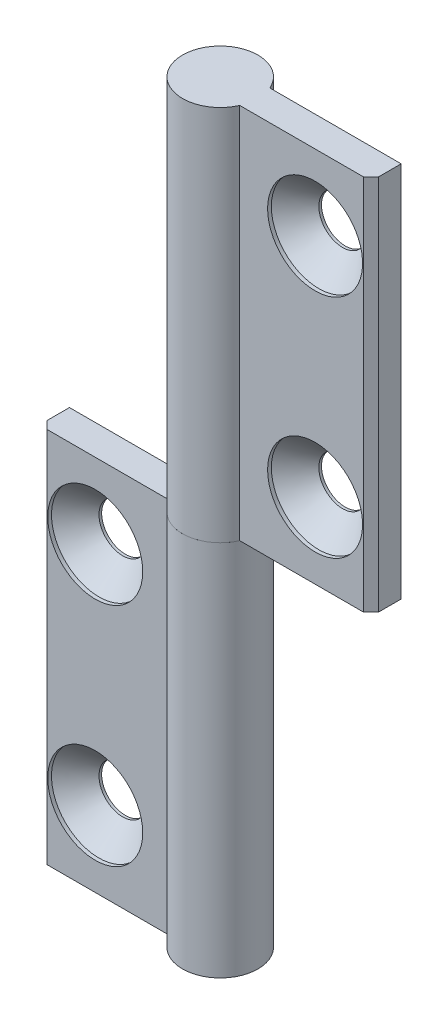
ISO-10303-21;
HEADER;
FILE_DESCRIPTION(('STEP AP214'),'2;1');
FILE_NAME('part.step','',(''),(''),'','','');
FILE_SCHEMA(('AUTOMOTIVE_DESIGN { 1 0 10303 214 1 1 1 1 }'));
ENDSEC;
DATA;
#1=APPLICATION_CONTEXT('core data for automotive mechanical design processes');
#2=APPLICATION_PROTOCOL_DEFINITION('international standard','automotive_design',2000,#1);
#3=PRODUCT_CONTEXT('',#1,'mechanical');
#4=PRODUCT('Part','Part','',(#3));
#5=PRODUCT_RELATED_PRODUCT_CATEGORY('part','',(#4));
#6=PRODUCT_DEFINITION_FORMATION('','',#4);
#7=PRODUCT_DEFINITION_CONTEXT('part definition',#1,'design');
#8=PRODUCT_DEFINITION('design','',#6,#7);
#9=PRODUCT_DEFINITION_SHAPE('','',#8);
#10=(LENGTH_UNIT() NAMED_UNIT(*) SI_UNIT(.MILLI.,.METRE.));
#11=(NAMED_UNIT(*) PLANE_ANGLE_UNIT() SI_UNIT($,.RADIAN.));
#12=(NAMED_UNIT(*) SI_UNIT($,.STERADIAN.) SOLID_ANGLE_UNIT());
#13=UNCERTAINTY_MEASURE_WITH_UNIT(LENGTH_MEASURE(1.E-05),#10,'distance_accuracy_value','');
#14=(GEOMETRIC_REPRESENTATION_CONTEXT(3) GLOBAL_UNCERTAINTY_ASSIGNED_CONTEXT((#13)) GLOBAL_UNIT_ASSIGNED_CONTEXT((#10,
#11,#12)) REPRESENTATION_CONTEXT('',''));
#15=CARTESIAN_POINT('',(0.,0.,0.));
#16=DIRECTION('',(0.,0.,1.));
#17=DIRECTION('',(1.,0.,0.));
#18=AXIS2_PLACEMENT_3D('',#15,#16,#17);
#19=CARTESIAN_POINT('',(0.,25.,0.));
#20=DIRECTION('',(0.,1.,0.));
#21=DIRECTION('',(0.,0.,-1.));
#22=AXIS2_PLACEMENT_3D('',#19,#20,#21);
#23=CYLINDRICAL_SURFACE('',#22,5.);
#24=CARTESIAN_POINT('',(0.,75.,0.));
#25=DIRECTION('',(0.,-1.,0.));
#26=DIRECTION('',(0.,0.,1.));
#27=AXIS2_PLACEMENT_3D('',#24,#25,#26);
#28=CIRCLE('',#27,5.);
#29=CARTESIAN_POINT('',(4.58257569495585,75.,1.99999999999997));
#30=VERTEX_POINT('',#29);
#31=CARTESIAN_POINT('',(4.58257569495582,75.,-2.00000000000004));
#32=VERTEX_POINT('',#31);
#33=EDGE_CURVE('E120',#30,#32,#28,.T.);
#34=ORIENTED_EDGE('',*,*,#33,.T.);
#35=DIRECTION('',(0.,1.,0.));
#36=VECTOR('',#35,1.);
#37=CARTESIAN_POINT('',(4.58257569495582,25.,-2.00000000000004));
#38=LINE('',#37,#36);
#39=CARTESIAN_POINT('',(4.58257569495582,25.,-2.00000000000004));
#40=VERTEX_POINT('',#39);
#41=EDGE_CURVE('E12',#40,#32,#38,.T.);
#42=ORIENTED_EDGE('',*,*,#41,.F.);
#43=CARTESIAN_POINT('',(0.,25.,0.));
#44=DIRECTION('',(0.,-1.,0.));
#45=DIRECTION('',(0.,0.,1.));
#46=AXIS2_PLACEMENT_3D('',#43,#44,#45);
#47=CIRCLE('',#46,5.);
#48=CARTESIAN_POINT('',(4.58257569495585,25.,1.99999999999997));
#49=VERTEX_POINT('',#48);
#50=EDGE_CURVE('E129',#49,#40,#47,.T.);
#51=ORIENTED_EDGE('',*,*,#50,.F.);
#52=DIRECTION('',(0.,1.,0.));
#53=VECTOR('',#52,1.);
#54=CARTESIAN_POINT('',(4.58257569495585,25.,1.99999999999997));
#55=LINE('',#54,#53);
#56=EDGE_CURVE('E116',#49,#30,#55,.T.);
#57=ORIENTED_EDGE('',*,*,#56,.T.);
#58=EDGE_LOOP('',(#34,#42,#51,#57));
#59=FACE_BOUND('',#58,.T.);
#60=ADVANCED_FACE('F44',(#59),#23,.T.);
#61=CARTESIAN_POINT('',(4.58257569495582,25.,-2.00000000000004));
#62=DIRECTION('',(0.,0.,1.));
#63=DIRECTION('',(-1.,0.,0.));
#64=AXIS2_PLACEMENT_3D('',#61,#62,#63);
#65=PLANE('',#64);
#66=CARTESIAN_POINT('',(14.5825756949558,35.,-2.00000000000011));
#67=DIRECTION('',(0.,0.,1.));
#68=DIRECTION('',(-1.,0.,0.));
#69=AXIS2_PLACEMENT_3D('',#66,#67,#68);
#70=CIRCLE('',#69,3.15);
#71=CARTESIAN_POINT('',(11.4325756949558,35.,-2.00000000000009));
#72=VERTEX_POINT('',#71);
#73=EDGE_CURVE('E47',#72,#72,#70,.T.);
#74=ORIENTED_EDGE('',*,*,#73,.T.);
#75=EDGE_LOOP('',(#74));
#76=FACE_BOUND('',#75,.T.);
#77=CARTESIAN_POINT('',(14.5825756949558,65.,-2.00000000000011));
#78=DIRECTION('',(0.,0.,1.));
#79=DIRECTION('',(-1.,0.,0.));
#80=AXIS2_PLACEMENT_3D('',#77,#78,#79);
#81=CIRCLE('',#80,3.15);
#82=CARTESIAN_POINT('',(11.4325756949558,65.,-2.00000000000009));
#83=VERTEX_POINT('',#82);
#84=EDGE_CURVE('E124',#83,#83,#81,.T.);
#85=ORIENTED_EDGE('',*,*,#84,.T.);
#86=EDGE_LOOP('',(#85));
#87=FACE_BOUND('',#86,.T.);
#88=DIRECTION('',(1.,0.,0.));
#89=VECTOR('',#88,1.);
#90=CARTESIAN_POINT('',(4.58257569495582,75.,-2.00000000000004));
#91=LINE('',#90,#89);
#92=CARTESIAN_POINT('',(22.,75.,-2.00000000000016));
#93=VERTEX_POINT('',#92);
#94=EDGE_CURVE('E123',#32,#93,#91,.T.);
#95=ORIENTED_EDGE('',*,*,#94,.T.);
#96=DIRECTION('',(0.,1.,0.));
#97=VECTOR('',#96,1.);
#98=CARTESIAN_POINT('',(22.,25.,-2.00000000000016));
#99=LINE('',#98,#97);
#100=CARTESIAN_POINT('',(22.,25.,-2.00000000000016));
#101=VERTEX_POINT('',#100);
#102=EDGE_CURVE('E53',#101,#93,#99,.T.);
#103=ORIENTED_EDGE('',*,*,#102,.F.);
#104=DIRECTION('',(1.,0.,0.));
#105=VECTOR('',#104,1.);
#106=CARTESIAN_POINT('',(4.58257569495582,25.,-2.00000000000004));
#107=LINE('',#106,#105);
#108=EDGE_CURVE('E96',#40,#101,#107,.T.);
#109=ORIENTED_EDGE('',*,*,#108,.F.);
#110=ORIENTED_EDGE('',*,*,#41,.T.);
#111=EDGE_LOOP('',(#95,#103,#109,#110));
#112=FACE_BOUND('',#111,.T.);
#113=ADVANCED_FACE('F150',(#76,#87,#112),#65,.F.);
#114=CARTESIAN_POINT('',(22.,25.,-2.00000000000016));
#115=DIRECTION('',(-1.,0.,0.));
#116=DIRECTION('',(0.,0.,-1.));
#117=AXIS2_PLACEMENT_3D('',#114,#115,#116);
#118=PLANE('',#117);
#119=DIRECTION('',(0.,0.,1.));
#120=VECTOR('',#119,1.);
#121=CARTESIAN_POINT('',(22.,75.,-2.00000000000016));
#122=LINE('',#121,#120);
#123=CARTESIAN_POINT('',(22.,75.,0.999999999999837));
#124=VERTEX_POINT('',#123);
#125=EDGE_CURVE('E111',#93,#124,#122,.T.);
#126=ORIENTED_EDGE('',*,*,#125,.T.);
#127=DIRECTION('',(0.,1.,0.));
#128=VECTOR('',#127,1.);
#129=CARTESIAN_POINT('',(22.,25.,0.999999999999837));
#130=LINE('',#129,#128);
#131=CARTESIAN_POINT('',(22.,25.,0.999999999999837));
#132=VERTEX_POINT('',#131);
#133=EDGE_CURVE('E108',#132,#124,#130,.T.);
#134=ORIENTED_EDGE('',*,*,#133,.F.);
#135=DIRECTION('',(0.,0.,1.));
#136=VECTOR('',#135,1.);
#137=CARTESIAN_POINT('',(22.,25.,-2.00000000000016));
#138=LINE('',#137,#136);
#139=EDGE_CURVE('E100',#101,#132,#138,.T.);
#140=ORIENTED_EDGE('',*,*,#139,.F.);
#141=ORIENTED_EDGE('',*,*,#102,.T.);
#142=EDGE_LOOP('',(#126,#134,#140,#141));
#143=FACE_BOUND('',#142,.T.);
#144=ADVANCED_FACE('F109',(#143),#118,.F.);
#145=CARTESIAN_POINT('',(22.,25.,0.999999999999837));
#146=DIRECTION('',(-0.707106781186549,0.,-0.707106781186546));
#147=DIRECTION('',(0.707106781186546,0.,-0.707106781186549));
#148=AXIS2_PLACEMENT_3D('',#145,#146,#147);
#149=PLANE('',#148);
#150=DIRECTION('',(-0.707106781186546,0.,0.707106781186549));
#151=VECTOR('',#150,1.);
#152=CARTESIAN_POINT('',(22.,75.,0.999999999999837));
#153=LINE('',#152,#151);
#154=CARTESIAN_POINT('',(21.,75.,1.99999999999984));
#155=VERTEX_POINT('',#154);
#156=EDGE_CURVE('E82',#124,#155,#153,.T.);
#157=ORIENTED_EDGE('',*,*,#156,.T.);
#158=DIRECTION('',(0.,1.,0.));
#159=VECTOR('',#158,1.);
#160=CARTESIAN_POINT('',(21.,25.,1.99999999999984));
#161=LINE('',#160,#159);
#162=CARTESIAN_POINT('',(21.,25.,1.99999999999984));
#163=VERTEX_POINT('',#162);
#164=EDGE_CURVE('E112',#163,#155,#161,.T.);
#165=ORIENTED_EDGE('',*,*,#164,.F.);
#166=DIRECTION('',(-0.707106781186546,0.,0.707106781186549));
#167=VECTOR('',#166,1.);
#168=CARTESIAN_POINT('',(22.,25.,0.999999999999837));
#169=LINE('',#168,#167);
#170=EDGE_CURVE('E104',#132,#163,#169,.T.);
#171=ORIENTED_EDGE('',*,*,#170,.F.);
#172=ORIENTED_EDGE('',*,*,#133,.T.);
#173=EDGE_LOOP('',(#157,#165,#171,#172));
#174=FACE_BOUND('',#173,.T.);
#175=ADVANCED_FACE('F114',(#174),#149,.F.);
#176=CARTESIAN_POINT('',(21.,25.,1.99999999999984));
#177=DIRECTION('',(0.,0.,-1.));
#178=DIRECTION('',(1.,0.,0.));
#179=AXIS2_PLACEMENT_3D('',#176,#177,#178);
#180=PLANE('',#179);
#181=CARTESIAN_POINT('',(14.5825756949559,35.,1.99999999999989));
#182=DIRECTION('',(0.,0.,1.));
#183=DIRECTION('',(-1.,0.,0.));
#184=AXIS2_PLACEMENT_3D('',#181,#182,#183);
#185=CIRCLE('',#184,6.3);
#186=CARTESIAN_POINT('',(8.28257569495585,35.,1.99999999999994));
#187=VERTEX_POINT('',#186);
#188=EDGE_CURVE('E184',#187,#187,#185,.T.);
#189=ORIENTED_EDGE('',*,*,#188,.F.);
#190=EDGE_LOOP('',(#189));
#191=FACE_BOUND('',#190,.T.);
#192=CARTESIAN_POINT('',(14.5825756949559,65.,1.99999999999989));
#193=DIRECTION('',(0.,0.,1.));
#194=DIRECTION('',(-1.,0.,0.));
#195=AXIS2_PLACEMENT_3D('',#192,#193,#194);
#196=CIRCLE('',#195,6.3);
#197=CARTESIAN_POINT('',(8.28257569495585,65.,1.99999999999994));
#198=VERTEX_POINT('',#197);
#199=EDGE_CURVE('E142',#198,#198,#196,.T.);
#200=ORIENTED_EDGE('',*,*,#199,.F.);
#201=EDGE_LOOP('',(#200));
#202=FACE_BOUND('',#201,.T.);
#203=DIRECTION('',(-1.,0.,0.));
#204=VECTOR('',#203,1.);
#205=CARTESIAN_POINT('',(21.,75.,1.99999999999984));
#206=LINE('',#205,#204);
#207=EDGE_CURVE('E88',#155,#30,#206,.T.);
#208=ORIENTED_EDGE('',*,*,#207,.T.);
#209=ORIENTED_EDGE('',*,*,#56,.F.);
#210=DIRECTION('',(-1.,0.,0.));
#211=VECTOR('',#210,1.);
#212=CARTESIAN_POINT('',(21.,25.,1.99999999999984));
#213=LINE('',#212,#211);
#214=EDGE_CURVE('E62',#163,#49,#213,.T.);
#215=ORIENTED_EDGE('',*,*,#214,.F.);
#216=ORIENTED_EDGE('',*,*,#164,.T.);
#217=EDGE_LOOP('',(#208,#209,#215,#216));
#218=FACE_BOUND('',#217,.T.);
#219=ADVANCED_FACE('F162',(#191,#202,#218),#180,.F.);
#220=CARTESIAN_POINT('',(0.,25.,0.));
#221=DIRECTION('',(0.,-1.,0.));
#222=DIRECTION('',(0.,0.,1.));
#223=AXIS2_PLACEMENT_3D('',#220,#221,#222);
#224=PLANE('',#223);
#225=ORIENTED_EDGE('',*,*,#50,.T.);
#226=ORIENTED_EDGE('',*,*,#108,.T.);
#227=ORIENTED_EDGE('',*,*,#139,.T.);
#228=ORIENTED_EDGE('',*,*,#170,.T.);
#229=ORIENTED_EDGE('',*,*,#214,.T.);
#230=EDGE_LOOP('',(#225,#226,#227,#228,#229));
#231=FACE_BOUND('',#230,.T.);
#232=ADVANCED_FACE('F102',(#231),#224,.T.);
#233=CARTESIAN_POINT('',(0.,75.,0.));
#234=DIRECTION('',(0.,-1.,0.));
#235=DIRECTION('',(0.,0.,1.));
#236=AXIS2_PLACEMENT_3D('',#233,#234,#235);
#237=PLANE('',#236);
#238=ORIENTED_EDGE('',*,*,#33,.F.);
#239=ORIENTED_EDGE('',*,*,#207,.F.);
#240=ORIENTED_EDGE('',*,*,#156,.F.);
#241=ORIENTED_EDGE('',*,*,#125,.F.);
#242=ORIENTED_EDGE('',*,*,#94,.F.);
#243=EDGE_LOOP('',(#238,#239,#240,#241,#242));
#244=FACE_BOUND('',#243,.T.);
#245=ADVANCED_FACE('F152',(#244),#237,.F.);
#246=CARTESIAN_POINT('',(14.5825756949559,65.,1.99999999999989));
#247=DIRECTION('',(0.,0.,1.));
#248=DIRECTION('',(-1.,0.,0.));
#249=AXIS2_PLACEMENT_3D('',#246,#247,#248);
#250=CYLINDRICAL_SURFACE('',#249,3.15);
#251=CARTESIAN_POINT('',(14.5825756949558,65.,-1.65000000000011));
#252=DIRECTION('',(0.,0.,1.));
#253=DIRECTION('',(-1.,0.,0.));
#254=AXIS2_PLACEMENT_3D('',#251,#252,#253);
#255=CIRCLE('',#254,3.15);
#256=CARTESIAN_POINT('',(11.4325756949558,65.,-1.65000000000008));
#257=VERTEX_POINT('',#256);
#258=EDGE_CURVE('E133',#257,#257,#255,.T.);
#259=ORIENTED_EDGE('',*,*,#258,.T.);
#260=EDGE_LOOP('',(#259));
#261=FACE_BOUND('',#260,.T.);
#262=ORIENTED_EDGE('',*,*,#84,.F.);
#263=EDGE_LOOP('',(#262));
#264=FACE_BOUND('',#263,.T.);
#265=ADVANCED_FACE('F154',(#261,#264),#250,.F.);
#266=CARTESIAN_POINT('',(14.5825756949558,65.,1.49999999999989));
#267=DIRECTION('',(0.,0.,1.));
#268=DIRECTION('',(-1.,0.,0.));
#269=AXIS2_PLACEMENT_3D('',#266,#267,#268);
#270=CONICAL_SURFACE('',#269,6.3,0.785398163397449);
#271=ORIENTED_EDGE('',*,*,#258,.F.);
#272=EDGE_LOOP('',(#271));
#273=FACE_BOUND('',#272,.T.);
#274=CARTESIAN_POINT('',(14.5825756949558,65.,1.49999999999989));
#275=DIRECTION('',(0.,0.,1.));
#276=DIRECTION('',(-1.,0.,0.));
#277=AXIS2_PLACEMENT_3D('',#274,#275,#276);
#278=CIRCLE('',#277,6.3);
#279=CARTESIAN_POINT('',(8.28257569495585,65.,1.49999999999994));
#280=VERTEX_POINT('',#279);
#281=EDGE_CURVE('E137',#280,#280,#278,.T.);
#282=ORIENTED_EDGE('',*,*,#281,.T.);
#283=EDGE_LOOP('',(#282));
#284=FACE_BOUND('',#283,.T.);
#285=ADVANCED_FACE('F160',(#273,#284),#270,.F.);
#286=CARTESIAN_POINT('',(14.5825756949559,65.,1.99999999999989));
#287=DIRECTION('',(0.,0.,1.));
#288=DIRECTION('',(-1.,0.,0.));
#289=AXIS2_PLACEMENT_3D('',#286,#287,#288);
#290=CYLINDRICAL_SURFACE('',#289,6.3);
#291=ORIENTED_EDGE('',*,*,#281,.F.);
#292=EDGE_LOOP('',(#291));
#293=FACE_BOUND('',#292,.T.);
#294=ORIENTED_EDGE('',*,*,#199,.T.);
#295=EDGE_LOOP('',(#294));
#296=FACE_BOUND('',#295,.T.);
#297=ADVANCED_FACE('F211',(#293,#296),#290,.F.);
#298=CARTESIAN_POINT('',(14.5825756949559,35.,1.99999999999989));
#299=DIRECTION('',(0.,0.,1.));
#300=DIRECTION('',(-1.,0.,0.));
#301=AXIS2_PLACEMENT_3D('',#298,#299,#300);
#302=CYLINDRICAL_SURFACE('',#301,3.15);
#303=CARTESIAN_POINT('',(14.5825756949558,35.,-1.65000000000011));
#304=DIRECTION('',(0.,0.,1.));
#305=DIRECTION('',(-1.,0.,0.));
#306=AXIS2_PLACEMENT_3D('',#303,#304,#305);
#307=CIRCLE('',#306,3.15);
#308=CARTESIAN_POINT('',(11.4325756949558,35.,-1.65000000000008));
#309=VERTEX_POINT('',#308);
#310=EDGE_CURVE('E188',#309,#309,#307,.T.);
#311=ORIENTED_EDGE('',*,*,#310,.T.);
#312=EDGE_LOOP('',(#311));
#313=FACE_BOUND('',#312,.T.);
#314=ORIENTED_EDGE('',*,*,#73,.F.);
#315=EDGE_LOOP('',(#314));
#316=FACE_BOUND('',#315,.T.);
#317=ADVANCED_FACE('F204',(#313,#316),#302,.F.);
#318=CARTESIAN_POINT('',(14.5825756949558,35.,1.49999999999989));
#319=DIRECTION('',(0.,0.,1.));
#320=DIRECTION('',(-1.,0.,0.));
#321=AXIS2_PLACEMENT_3D('',#318,#319,#320);
#322=CONICAL_SURFACE('',#321,6.3,0.785398163397449);
#323=ORIENTED_EDGE('',*,*,#310,.F.);
#324=EDGE_LOOP('',(#323));
#325=FACE_BOUND('',#324,.T.);
#326=CARTESIAN_POINT('',(14.5825756949558,35.,1.49999999999989));
#327=DIRECTION('',(0.,0.,1.));
#328=DIRECTION('',(-1.,0.,0.));
#329=AXIS2_PLACEMENT_3D('',#326,#327,#328);
#330=CIRCLE('',#329,6.3);
#331=CARTESIAN_POINT('',(8.28257569495585,35.,1.49999999999994));
#332=VERTEX_POINT('',#331);
#333=EDGE_CURVE('E192',#332,#332,#330,.T.);
#334=ORIENTED_EDGE('',*,*,#333,.T.);
#335=EDGE_LOOP('',(#334));
#336=FACE_BOUND('',#335,.T.);
#337=ADVANCED_FACE('F198',(#325,#336),#322,.F.);
#338=CARTESIAN_POINT('',(14.5825756949559,35.,1.99999999999989));
#339=DIRECTION('',(0.,0.,1.));
#340=DIRECTION('',(-1.,0.,0.));
#341=AXIS2_PLACEMENT_3D('',#338,#339,#340);
#342=CYLINDRICAL_SURFACE('',#341,6.3);
#343=ORIENTED_EDGE('',*,*,#333,.F.);
#344=EDGE_LOOP('',(#343));
#345=FACE_BOUND('',#344,.T.);
#346=ORIENTED_EDGE('',*,*,#188,.T.);
#347=EDGE_LOOP('',(#346));
#348=FACE_BOUND('',#347,.T.);
#349=ADVANCED_FACE('F196',(#345,#348),#342,.F.);
#350=CLOSED_SHELL('',(#60,#113,#144,#175,#219,#232,#245,#265,#285,#297,#317,#337,#349));
#351=MANIFOLD_SOLID_BREP('B2',#350);
#352=CARTESIAN_POINT('',(0.,25.,0.));
#353=DIRECTION('',(0.,-1.,0.));
#354=DIRECTION('',(0.,0.,-1.));
#355=AXIS2_PLACEMENT_3D('',#352,#353,#354);
#356=CYLINDRICAL_SURFACE('',#355,5.);
#357=CARTESIAN_POINT('',(0.,-25.,0.));
#358=DIRECTION('',(0.,1.,0.));
#359=DIRECTION('',(0.,0.,1.));
#360=AXIS2_PLACEMENT_3D('',#357,#358,#359);
#361=CIRCLE('',#360,5.);
#362=CARTESIAN_POINT('',(-4.58257569495584,-25.,2.));
#363=VERTEX_POINT('',#362);
#364=CARTESIAN_POINT('',(-4.58257569495584,-25.,-2.));
#365=VERTEX_POINT('',#364);
#366=EDGE_CURVE('E371',#363,#365,#361,.T.);
#367=ORIENTED_EDGE('',*,*,#366,.T.);
#368=DIRECTION('',(0.,-1.,0.));
#369=VECTOR('',#368,1.);
#370=CARTESIAN_POINT('',(-4.58257569495584,25.,-2.));
#371=LINE('',#370,#369);
#372=CARTESIAN_POINT('',(-4.58257569495584,25.,-2.));
#373=VERTEX_POINT('',#372);
#374=EDGE_CURVE('E42',#373,#365,#371,.T.);
#375=ORIENTED_EDGE('',*,*,#374,.F.);
#376=CARTESIAN_POINT('',(0.,25.,0.));
#377=DIRECTION('',(0.,1.,0.));
#378=DIRECTION('',(0.,0.,1.));
#379=AXIS2_PLACEMENT_3D('',#376,#377,#378);
#380=CIRCLE('',#379,5.);
#381=CARTESIAN_POINT('',(-4.58257569495584,25.,2.));
#382=VERTEX_POINT('',#381);
#383=EDGE_CURVE('E380',#382,#373,#380,.T.);
#384=ORIENTED_EDGE('',*,*,#383,.F.);
#385=DIRECTION('',(0.,-1.,0.));
#386=VECTOR('',#385,1.);
#387=CARTESIAN_POINT('',(-4.58257569495584,25.,2.));
#388=LINE('',#387,#386);
#389=EDGE_CURVE('E367',#382,#363,#388,.T.);
#390=ORIENTED_EDGE('',*,*,#389,.T.);
#391=EDGE_LOOP('',(#367,#375,#384,#390));
#392=FACE_BOUND('',#391,.T.);
#393=ADVANCED_FACE('F295',(#392),#356,.T.);
#394=CARTESIAN_POINT('',(-4.58257569495584,25.,-2.));
#395=DIRECTION('',(0.,0.,1.));
#396=DIRECTION('',(1.,0.,0.));
#397=AXIS2_PLACEMENT_3D('',#394,#395,#396);
#398=PLANE('',#397);
#399=CARTESIAN_POINT('',(-14.5825756949558,15.,-2.));
#400=DIRECTION('',(0.,0.,1.));
#401=DIRECTION('',(1.,0.,0.));
#402=AXIS2_PLACEMENT_3D('',#399,#400,#401);
#403=CIRCLE('',#402,3.15);
#404=CARTESIAN_POINT('',(-11.4325756949558,15.,-2.));
#405=VERTEX_POINT('',#404);
#406=EDGE_CURVE('E298',#405,#405,#403,.T.);
#407=ORIENTED_EDGE('',*,*,#406,.T.);
#408=EDGE_LOOP('',(#407));
#409=FACE_BOUND('',#408,.T.);
#410=CARTESIAN_POINT('',(-14.5825756949558,-15.,-2.));
#411=DIRECTION('',(0.,0.,1.));
#412=DIRECTION('',(1.,0.,0.));
#413=AXIS2_PLACEMENT_3D('',#410,#411,#412);
#414=CIRCLE('',#413,3.15);
#415=CARTESIAN_POINT('',(-11.4325756949558,-15.,-2.));
#416=VERTEX_POINT('',#415);
#417=EDGE_CURVE('E375',#416,#416,#414,.T.);
#418=ORIENTED_EDGE('',*,*,#417,.T.);
#419=EDGE_LOOP('',(#418));
#420=FACE_BOUND('',#419,.T.);
#421=DIRECTION('',(-1.,0.,0.));
#422=VECTOR('',#421,1.);
#423=CARTESIAN_POINT('',(-4.58257569495584,-25.,-2.));
#424=LINE('',#423,#422);
#425=CARTESIAN_POINT('',(-22.,-25.,-2.));
#426=VERTEX_POINT('',#425);
#427=EDGE_CURVE('E374',#365,#426,#424,.T.);
#428=ORIENTED_EDGE('',*,*,#427,.T.);
#429=DIRECTION('',(0.,-1.,0.));
#430=VECTOR('',#429,1.);
#431=CARTESIAN_POINT('',(-22.,25.,-2.));
#432=LINE('',#431,#430);
#433=CARTESIAN_POINT('',(-22.,25.,-2.));
#434=VERTEX_POINT('',#433);
#435=EDGE_CURVE('E304',#434,#426,#432,.T.);
#436=ORIENTED_EDGE('',*,*,#435,.F.);
#437=DIRECTION('',(-1.,0.,0.));
#438=VECTOR('',#437,1.);
#439=CARTESIAN_POINT('',(-4.58257569495584,25.,-2.));
#440=LINE('',#439,#438);
#441=EDGE_CURVE('E347',#373,#434,#440,.T.);
#442=ORIENTED_EDGE('',*,*,#441,.F.);
#443=ORIENTED_EDGE('',*,*,#374,.T.);
#444=EDGE_LOOP('',(#428,#436,#442,#443));
#445=FACE_BOUND('',#444,.T.);
#446=ADVANCED_FACE('F401',(#409,#420,#445),#398,.F.);
#447=CARTESIAN_POINT('',(-22.,25.,-2.));
#448=DIRECTION('',(1.,0.,0.));
#449=DIRECTION('',(0.,0.,-1.));
#450=AXIS2_PLACEMENT_3D('',#447,#448,#449);
#451=PLANE('',#450);
#452=DIRECTION('',(0.,0.,1.));
#453=VECTOR('',#452,1.);
#454=CARTESIAN_POINT('',(-22.,-25.,-2.));
#455=LINE('',#454,#453);
#456=CARTESIAN_POINT('',(-22.,-25.,1.));
#457=VERTEX_POINT('',#456);
#458=EDGE_CURVE('E362',#426,#457,#455,.T.);
#459=ORIENTED_EDGE('',*,*,#458,.T.);
#460=DIRECTION('',(0.,-1.,0.));
#461=VECTOR('',#460,1.);
#462=CARTESIAN_POINT('',(-22.,25.,1.));
#463=LINE('',#462,#461);
#464=CARTESIAN_POINT('',(-22.,25.,1.));
#465=VERTEX_POINT('',#464);
#466=EDGE_CURVE('E359',#465,#457,#463,.T.);
#467=ORIENTED_EDGE('',*,*,#466,.F.);
#468=DIRECTION('',(0.,0.,1.));
#469=VECTOR('',#468,1.);
#470=CARTESIAN_POINT('',(-22.,25.,-2.));
#471=LINE('',#470,#469);
#472=EDGE_CURVE('E351',#434,#465,#471,.T.);
#473=ORIENTED_EDGE('',*,*,#472,.F.);
#474=ORIENTED_EDGE('',*,*,#435,.T.);
#475=EDGE_LOOP('',(#459,#467,#473,#474));
#476=FACE_BOUND('',#475,.T.);
#477=ADVANCED_FACE('F360',(#476),#451,.F.);
#478=CARTESIAN_POINT('',(-22.,25.,1.));
#479=DIRECTION('',(0.707106781186543,0.,-0.707106781186552));
#480=DIRECTION('',(-0.707106781186552,0.,-0.707106781186543));
#481=AXIS2_PLACEMENT_3D('',#478,#479,#480);
#482=PLANE('',#481);
#483=DIRECTION('',(0.707106781186552,0.,0.707106781186543));
#484=VECTOR('',#483,1.);
#485=CARTESIAN_POINT('',(-22.,-25.,1.));
#486=LINE('',#485,#484);
#487=CARTESIAN_POINT('',(-21.,-25.,2.));
#488=VERTEX_POINT('',#487);
#489=EDGE_CURVE('E333',#457,#488,#486,.T.);
#490=ORIENTED_EDGE('',*,*,#489,.T.);
#491=DIRECTION('',(0.,-1.,0.));
#492=VECTOR('',#491,1.);
#493=CARTESIAN_POINT('',(-21.,25.,2.));
#494=LINE('',#493,#492);
#495=CARTESIAN_POINT('',(-21.,25.,2.));
#496=VERTEX_POINT('',#495);
#497=EDGE_CURVE('E363',#496,#488,#494,.T.);
#498=ORIENTED_EDGE('',*,*,#497,.F.);
#499=DIRECTION('',(0.707106781186552,0.,0.707106781186543));
#500=VECTOR('',#499,1.);
#501=CARTESIAN_POINT('',(-22.,25.,1.));
#502=LINE('',#501,#500);
#503=EDGE_CURVE('E355',#465,#496,#502,.T.);
#504=ORIENTED_EDGE('',*,*,#503,.F.);
#505=ORIENTED_EDGE('',*,*,#466,.T.);
#506=EDGE_LOOP('',(#490,#498,#504,#505));
#507=FACE_BOUND('',#506,.T.);
#508=ADVANCED_FACE('F365',(#507),#482,.F.);
#509=CARTESIAN_POINT('',(-21.,25.,2.));
#510=DIRECTION('',(0.,0.,-1.));
#511=DIRECTION('',(-1.,0.,0.));
#512=AXIS2_PLACEMENT_3D('',#509,#510,#511);
#513=PLANE('',#512);
#514=CARTESIAN_POINT('',(-14.5825756949558,15.,2.));
#515=DIRECTION('',(0.,0.,1.));
#516=DIRECTION('',(1.,0.,0.));
#517=AXIS2_PLACEMENT_3D('',#514,#515,#516);
#518=CIRCLE('',#517,6.3);
#519=CARTESIAN_POINT('',(-8.28257569495584,15.,2.));
#520=VERTEX_POINT('',#519);
#521=EDGE_CURVE('E435',#520,#520,#518,.T.);
#522=ORIENTED_EDGE('',*,*,#521,.F.);
#523=EDGE_LOOP('',(#522));
#524=FACE_BOUND('',#523,.T.);
#525=CARTESIAN_POINT('',(-14.5825756949558,-15.,2.));
#526=DIRECTION('',(0.,0.,1.));
#527=DIRECTION('',(1.,0.,0.));
#528=AXIS2_PLACEMENT_3D('',#525,#526,#527);
#529=CIRCLE('',#528,6.3);
#530=CARTESIAN_POINT('',(-8.28257569495584,-15.,2.));
#531=VERTEX_POINT('',#530);
#532=EDGE_CURVE('E393',#531,#531,#529,.T.);
#533=ORIENTED_EDGE('',*,*,#532,.F.);
#534=EDGE_LOOP('',(#533));
#535=FACE_BOUND('',#534,.T.);
#536=DIRECTION('',(1.,0.,0.));
#537=VECTOR('',#536,1.);
#538=CARTESIAN_POINT('',(-21.,-25.,2.));
#539=LINE('',#538,#537);
#540=EDGE_CURVE('E339',#488,#363,#539,.T.);
#541=ORIENTED_EDGE('',*,*,#540,.T.);
#542=ORIENTED_EDGE('',*,*,#389,.F.);
#543=DIRECTION('',(1.,0.,0.));
#544=VECTOR('',#543,1.);
#545=CARTESIAN_POINT('',(-21.,25.,2.));
#546=LINE('',#545,#544);
#547=EDGE_CURVE('E313',#496,#382,#546,.T.);
#548=ORIENTED_EDGE('',*,*,#547,.F.);
#549=ORIENTED_EDGE('',*,*,#497,.T.);
#550=EDGE_LOOP('',(#541,#542,#548,#549));
#551=FACE_BOUND('',#550,.T.);
#552=ADVANCED_FACE('F413',(#524,#535,#551),#513,.F.);
#553=CARTESIAN_POINT('',(0.,25.,0.));
#554=DIRECTION('',(0.,1.,0.));
#555=DIRECTION('',(0.,0.,1.));
#556=AXIS2_PLACEMENT_3D('',#553,#554,#555);
#557=PLANE('',#556);
#558=ORIENTED_EDGE('',*,*,#383,.T.);
#559=ORIENTED_EDGE('',*,*,#441,.T.);
#560=ORIENTED_EDGE('',*,*,#472,.T.);
#561=ORIENTED_EDGE('',*,*,#503,.T.);
#562=ORIENTED_EDGE('',*,*,#547,.T.);
#563=EDGE_LOOP('',(#558,#559,#560,#561,#562));
#564=FACE_BOUND('',#563,.T.);
#565=ADVANCED_FACE('F353',(#564),#557,.T.);
#566=CARTESIAN_POINT('',(0.,-25.,0.));
#567=DIRECTION('',(0.,1.,0.));
#568=DIRECTION('',(0.,0.,1.));
#569=AXIS2_PLACEMENT_3D('',#566,#567,#568);
#570=PLANE('',#569);
#571=ORIENTED_EDGE('',*,*,#366,.F.);
#572=ORIENTED_EDGE('',*,*,#540,.F.);
#573=ORIENTED_EDGE('',*,*,#489,.F.);
#574=ORIENTED_EDGE('',*,*,#458,.F.);
#575=ORIENTED_EDGE('',*,*,#427,.F.);
#576=EDGE_LOOP('',(#571,#572,#573,#574,#575));
#577=FACE_BOUND('',#576,.T.);
#578=ADVANCED_FACE('F403',(#577),#570,.F.);
#579=CARTESIAN_POINT('',(-14.5825756949558,-15.,2.));
#580=DIRECTION('',(0.,0.,1.));
#581=DIRECTION('',(1.,0.,0.));
#582=AXIS2_PLACEMENT_3D('',#579,#580,#581);
#583=CYLINDRICAL_SURFACE('',#582,3.15);
#584=CARTESIAN_POINT('',(-14.5825756949558,-15.,-1.65));
#585=DIRECTION('',(0.,0.,1.));
#586=DIRECTION('',(1.,0.,0.));
#587=AXIS2_PLACEMENT_3D('',#584,#585,#586);
#588=CIRCLE('',#587,3.15);
#589=CARTESIAN_POINT('',(-11.4325756949558,-15.,-1.65));
#590=VERTEX_POINT('',#589);
#591=EDGE_CURVE('E384',#590,#590,#588,.T.);
#592=ORIENTED_EDGE('',*,*,#591,.T.);
#593=EDGE_LOOP('',(#592));
#594=FACE_BOUND('',#593,.T.);
#595=ORIENTED_EDGE('',*,*,#417,.F.);
#596=EDGE_LOOP('',(#595));
#597=FACE_BOUND('',#596,.T.);
#598=ADVANCED_FACE('F405',(#594,#597),#583,.F.);
#599=CARTESIAN_POINT('',(-14.5825756949558,-15.,1.5));
#600=DIRECTION('',(0.,0.,1.));
#601=DIRECTION('',(1.,0.,0.));
#602=AXIS2_PLACEMENT_3D('',#599,#600,#601);
#603=CONICAL_SURFACE('',#602,6.3,0.785398163397449);
#604=ORIENTED_EDGE('',*,*,#591,.F.);
#605=EDGE_LOOP('',(#604));
#606=FACE_BOUND('',#605,.T.);
#607=CARTESIAN_POINT('',(-14.5825756949558,-15.,1.5));
#608=DIRECTION('',(0.,0.,1.));
#609=DIRECTION('',(1.,0.,0.));
#610=AXIS2_PLACEMENT_3D('',#607,#608,#609);
#611=CIRCLE('',#610,6.3);
#612=CARTESIAN_POINT('',(-8.28257569495584,-15.,1.5));
#613=VERTEX_POINT('',#612);
#614=EDGE_CURVE('E388',#613,#613,#611,.T.);
#615=ORIENTED_EDGE('',*,*,#614,.T.);
#616=EDGE_LOOP('',(#615));
#617=FACE_BOUND('',#616,.T.);
#618=ADVANCED_FACE('F411',(#606,#617),#603,.F.);
#619=CARTESIAN_POINT('',(-14.5825756949558,-15.,2.));
#620=DIRECTION('',(0.,0.,1.));
#621=DIRECTION('',(1.,0.,0.));
#622=AXIS2_PLACEMENT_3D('',#619,#620,#621);
#623=CYLINDRICAL_SURFACE('',#622,6.3);
#624=ORIENTED_EDGE('',*,*,#614,.F.);
#625=EDGE_LOOP('',(#624));
#626=FACE_BOUND('',#625,.T.);
#627=ORIENTED_EDGE('',*,*,#532,.T.);
#628=EDGE_LOOP('',(#627));
#629=FACE_BOUND('',#628,.T.);
#630=ADVANCED_FACE('F462',(#626,#629),#623,.F.);
#631=CARTESIAN_POINT('',(-14.5825756949558,15.,2.));
#632=DIRECTION('',(0.,0.,1.));
#633=DIRECTION('',(1.,0.,0.));
#634=AXIS2_PLACEMENT_3D('',#631,#632,#633);
#635=CYLINDRICAL_SURFACE('',#634,3.15);
#636=CARTESIAN_POINT('',(-14.5825756949558,15.,-1.65));
#637=DIRECTION('',(0.,0.,1.));
#638=DIRECTION('',(1.,0.,0.));
#639=AXIS2_PLACEMENT_3D('',#636,#637,#638);
#640=CIRCLE('',#639,3.15);
#641=CARTESIAN_POINT('',(-11.4325756949558,15.,-1.65));
#642=VERTEX_POINT('',#641);
#643=EDGE_CURVE('E439',#642,#642,#640,.T.);
#644=ORIENTED_EDGE('',*,*,#643,.T.);
#645=EDGE_LOOP('',(#644));
#646=FACE_BOUND('',#645,.T.);
#647=ORIENTED_EDGE('',*,*,#406,.F.);
#648=EDGE_LOOP('',(#647));
#649=FACE_BOUND('',#648,.T.);
#650=ADVANCED_FACE('F455',(#646,#649),#635,.F.);
#651=CARTESIAN_POINT('',(-14.5825756949558,15.,1.5));
#652=DIRECTION('',(0.,0.,1.));
#653=DIRECTION('',(1.,0.,0.));
#654=AXIS2_PLACEMENT_3D('',#651,#652,#653);
#655=CONICAL_SURFACE('',#654,6.3,0.785398163397449);
#656=ORIENTED_EDGE('',*,*,#643,.F.);
#657=EDGE_LOOP('',(#656));
#658=FACE_BOUND('',#657,.T.);
#659=CARTESIAN_POINT('',(-14.5825756949558,15.,1.5));
#660=DIRECTION('',(0.,0.,1.));
#661=DIRECTION('',(1.,0.,0.));
#662=AXIS2_PLACEMENT_3D('',#659,#660,#661);
#663=CIRCLE('',#662,6.3);
#664=CARTESIAN_POINT('',(-8.28257569495584,15.,1.5));
#665=VERTEX_POINT('',#664);
#666=EDGE_CURVE('E443',#665,#665,#663,.T.);
#667=ORIENTED_EDGE('',*,*,#666,.T.);
#668=EDGE_LOOP('',(#667));
#669=FACE_BOUND('',#668,.T.);
#670=ADVANCED_FACE('F449',(#658,#669),#655,.F.);
#671=CARTESIAN_POINT('',(-14.5825756949558,15.,2.));
#672=DIRECTION('',(0.,0.,1.));
#673=DIRECTION('',(1.,0.,0.));
#674=AXIS2_PLACEMENT_3D('',#671,#672,#673);
#675=CYLINDRICAL_SURFACE('',#674,6.3);
#676=ORIENTED_EDGE('',*,*,#666,.F.);
#677=EDGE_LOOP('',(#676));
#678=FACE_BOUND('',#677,.T.);
#679=ORIENTED_EDGE('',*,*,#521,.T.);
#680=EDGE_LOOP('',(#679));
#681=FACE_BOUND('',#680,.T.);
#682=ADVANCED_FACE('F447',(#678,#681),#675,.F.);
#683=CLOSED_SHELL('',(#393,#446,#477,#508,#552,#565,#578,#598,#618,#630,#650,#670,#682));
#684=MANIFOLD_SOLID_BREP('B6',#683);
#685=ADVANCED_BREP_SHAPE_REPRESENTATION('',(#18,#351,#684),#14);
#686=SHAPE_DEFINITION_REPRESENTATION(#9,#685);
ENDSEC;
END-ISO-10303-21;
